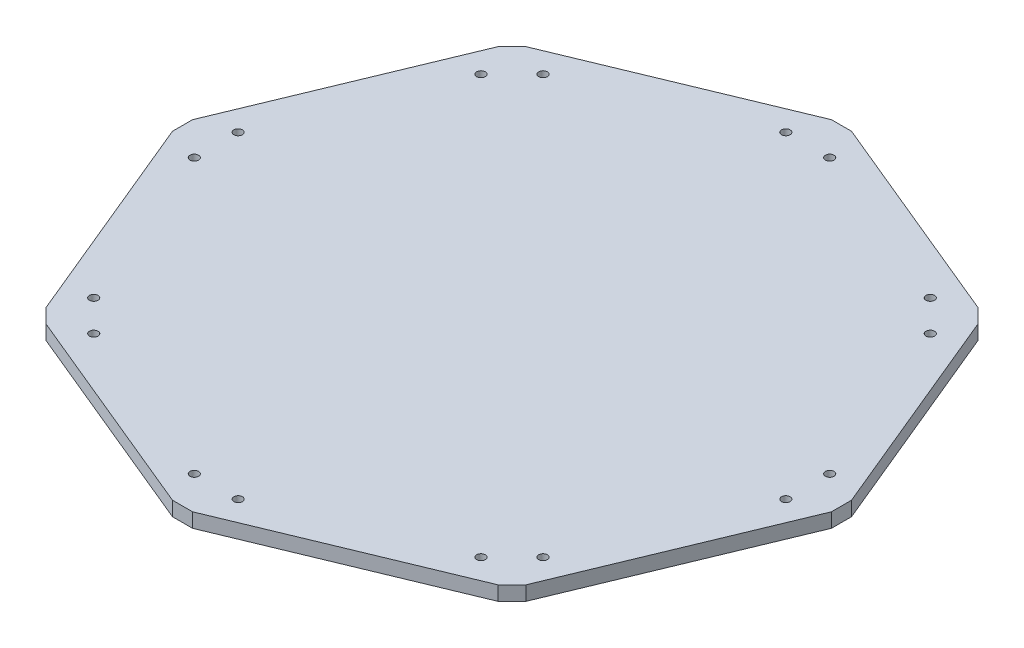
ISO-10303-21;
HEADER;
FILE_DESCRIPTION(('STEP AP214'),'2;1');
FILE_NAME('part.step','',(''),(''),'','','');
FILE_SCHEMA(('AUTOMOTIVE_DESIGN { 1 0 10303 214 1 1 1 1 }'));
ENDSEC;
DATA;
#1=APPLICATION_CONTEXT('core data for automotive mechanical design processes');
#2=APPLICATION_PROTOCOL_DEFINITION('international standard','automotive_design',2000,#1);
#3=PRODUCT_CONTEXT('',#1,'mechanical');
#4=PRODUCT('Part','Part','',(#3));
#5=PRODUCT_RELATED_PRODUCT_CATEGORY('part','',(#4));
#6=PRODUCT_DEFINITION_FORMATION('','',#4);
#7=PRODUCT_DEFINITION_CONTEXT('part definition',#1,'design');
#8=PRODUCT_DEFINITION('design','',#6,#7);
#9=PRODUCT_DEFINITION_SHAPE('','',#8);
#10=(LENGTH_UNIT() NAMED_UNIT(*) SI_UNIT(.MILLI.,.METRE.));
#11=(NAMED_UNIT(*) PLANE_ANGLE_UNIT() SI_UNIT($,.RADIAN.));
#12=(NAMED_UNIT(*) SI_UNIT($,.STERADIAN.) SOLID_ANGLE_UNIT());
#13=UNCERTAINTY_MEASURE_WITH_UNIT(LENGTH_MEASURE(1.E-05),#10,'distance_accuracy_value','');
#14=(GEOMETRIC_REPRESENTATION_CONTEXT(3) GLOBAL_UNCERTAINTY_ASSIGNED_CONTEXT((#13)) GLOBAL_UNIT_ASSIGNED_CONTEXT((#10,
#11,#12)) REPRESENTATION_CONTEXT('',''));
#15=CARTESIAN_POINT('',(0.,0.,0.));
#16=DIRECTION('',(0.,0.,1.));
#17=DIRECTION('',(1.,0.,0.));
#18=AXIS2_PLACEMENT_3D('',#15,#16,#17);
#19=CARTESIAN_POINT('',(12953.3155356963,5.,26694.8257165079));
#20=DIRECTION('',(0.,-1.,0.));
#21=DIRECTION('',(0.,0.,-1.));
#22=AXIS2_PLACEMENT_3D('',#19,#20,#21);
#23=PLANE('',#22);
#24=DIRECTION('',(0.923879532511295,0.,0.382683432365071));
#25=VECTOR('',#24,1.);
#26=CARTESIAN_POINT('',(12946.3155356963,5.,26924.8257165079));
#27=LINE('',#26,#25);
#28=CARTESIAN_POINT('',(12946.3155356963,5.,26924.8257165079));
#29=VERTEX_POINT('',#28);
#30=CARTESIAN_POINT('',(12795.6307234917,5.,26862.4100236491));
#31=VERTEX_POINT('',#30);
#32=EDGE_CURVE('E683',#29,#31,#27,.F.);
#33=ORIENTED_EDGE('',*,*,#32,.F.);
#34=DIRECTION('',(1.,0.,0.));
#35=VECTOR('',#34,1.);
#36=CARTESIAN_POINT('',(12960.3155356963,5.,26924.8257165079));
#37=LINE('',#36,#35);
#38=CARTESIAN_POINT('',(12960.3155356963,5.,26924.8257165079));
#39=VERTEX_POINT('',#38);
#40=EDGE_CURVE('E688',#39,#29,#37,.F.);
#41=ORIENTED_EDGE('',*,*,#40,.F.);
#42=DIRECTION('',(0.923879532511271,0.,-0.382683432365128));
#43=VECTOR('',#42,1.);
#44=CARTESIAN_POINT('',(13111.0003479009,5.,26862.4100236491));
#45=LINE('',#44,#43);
#46=CARTESIAN_POINT('',(13111.0003479009,5.,26862.4100236491));
#47=VERTEX_POINT('',#46);
#48=EDGE_CURVE('E693',#47,#39,#45,.F.);
#49=ORIENTED_EDGE('',*,*,#48,.F.);
#50=DIRECTION('',(0.707106781186548,0.,-0.707106781186548));
#51=VECTOR('',#50,1.);
#52=CARTESIAN_POINT('',(13120.8998428375,5.,26852.5105287125));
#53=LINE('',#52,#51);
#54=CARTESIAN_POINT('',(13120.8998428375,5.,26852.5105287125));
#55=VERTEX_POINT('',#54);
#56=EDGE_CURVE('E699',#55,#47,#53,.F.);
#57=ORIENTED_EDGE('',*,*,#56,.F.);
#58=DIRECTION('',(0.382683432365001,0.,-0.923879532511323));
#59=VECTOR('',#58,1.);
#60=CARTESIAN_POINT('',(13183.3155356963,5.,26701.8257165079));
#61=LINE('',#60,#59);
#62=CARTESIAN_POINT('',(13183.3155356963,5.,26701.8257165079));
#63=VERTEX_POINT('',#62);
#64=EDGE_CURVE('E705',#63,#55,#61,.F.);
#65=ORIENTED_EDGE('',*,*,#64,.F.);
#66=DIRECTION('',(-4.87229304521338E-13,0.,-1.));
#67=VECTOR('',#66,1.);
#68=CARTESIAN_POINT('',(13183.3155356963,5.,26687.8257165079));
#69=LINE('',#68,#67);
#70=CARTESIAN_POINT('',(13183.3155356963,5.,26687.8257165079));
#71=VERTEX_POINT('',#70);
#72=EDGE_CURVE('E711',#71,#63,#69,.F.);
#73=ORIENTED_EDGE('',*,*,#72,.F.);
#74=DIRECTION('',(-0.382683432365128,0.,-0.923879532511271));
#75=VECTOR('',#74,1.);
#76=CARTESIAN_POINT('',(13120.8998428375,5.,26537.1409043033));
#77=LINE('',#76,#75);
#78=CARTESIAN_POINT('',(13120.8998428375,5.,26537.1409043033));
#79=VERTEX_POINT('',#78);
#80=EDGE_CURVE('E717',#79,#71,#77,.F.);
#81=ORIENTED_EDGE('',*,*,#80,.F.);
#82=DIRECTION('',(-0.707106781187035,0.,-0.70710678118606));
#83=VECTOR('',#82,1.);
#84=CARTESIAN_POINT('',(13111.0003479009,5.,26527.2414093667));
#85=LINE('',#84,#83);
#86=CARTESIAN_POINT('',(13111.0003479009,5.,26527.2414093667));
#87=VERTEX_POINT('',#86);
#88=EDGE_CURVE('E723',#87,#79,#85,.F.);
#89=ORIENTED_EDGE('',*,*,#88,.F.);
#90=DIRECTION('',(-0.923879532511295,0.,-0.382683432365071));
#91=VECTOR('',#90,1.);
#92=CARTESIAN_POINT('',(12960.3155356963,5.,26464.8257165079));
#93=LINE('',#92,#91);
#94=CARTESIAN_POINT('',(12960.3155356963,5.,26464.8257165079));
#95=VERTEX_POINT('',#94);
#96=EDGE_CURVE('E729',#95,#87,#93,.F.);
#97=ORIENTED_EDGE('',*,*,#96,.F.);
#98=DIRECTION('',(-1.,0.,6.49639072695118E-13));
#99=VECTOR('',#98,1.);
#100=CARTESIAN_POINT('',(12946.3155356963,5.,26464.8257165079));
#101=LINE('',#100,#99);
#102=CARTESIAN_POINT('',(12946.3155356963,5.,26464.8257165079));
#103=VERTEX_POINT('',#102);
#104=EDGE_CURVE('E735',#103,#95,#101,.F.);
#105=ORIENTED_EDGE('',*,*,#104,.F.);
#106=DIRECTION('',(-0.923879532511271,0.,0.382683432365128));
#107=VECTOR('',#106,1.);
#108=CARTESIAN_POINT('',(12795.6307234917,5.,26527.2414093667));
#109=LINE('',#108,#107);
#110=CARTESIAN_POINT('',(12795.6307234917,5.,26527.2414093667));
#111=VERTEX_POINT('',#110);
#112=EDGE_CURVE('E741',#111,#103,#109,.F.);
#113=ORIENTED_EDGE('',*,*,#112,.F.);
#114=DIRECTION('',(-0.707106781186142,0.,0.707106781186954));
#115=VECTOR('',#114,1.);
#116=CARTESIAN_POINT('',(12785.7312285551,5.,26537.1409043033));
#117=LINE('',#116,#115);
#118=CARTESIAN_POINT('',(12785.7312285551,5.,26537.1409043033));
#119=VERTEX_POINT('',#118);
#120=EDGE_CURVE('E747',#119,#111,#117,.F.);
#121=ORIENTED_EDGE('',*,*,#120,.F.);
#122=DIRECTION('',(-0.382683432365047,0.,0.923879532511305));
#123=VECTOR('',#122,1.);
#124=CARTESIAN_POINT('',(12723.3155356963,5.,26687.8257165079));
#125=LINE('',#124,#123);
#126=CARTESIAN_POINT('',(12723.3155356963,5.,26687.8257165079));
#127=VERTEX_POINT('',#126);
#128=EDGE_CURVE('E751',#127,#119,#125,.F.);
#129=ORIENTED_EDGE('',*,*,#128,.F.);
#130=DIRECTION('',(4.87229304521338E-13,0.,1.));
#131=VECTOR('',#130,1.);
#132=CARTESIAN_POINT('',(12723.3155356963,5.,26701.8257165079));
#133=LINE('',#132,#131);
#134=CARTESIAN_POINT('',(12723.3155356963,5.,26701.8257165079));
#135=VERTEX_POINT('',#134);
#136=EDGE_CURVE('E128',#135,#127,#133,.F.);
#137=ORIENTED_EDGE('',*,*,#136,.F.);
#138=DIRECTION('',(0.382683432365128,0.,0.923879532511271));
#139=VECTOR('',#138,1.);
#140=CARTESIAN_POINT('',(12785.7312285551,5.,26852.5105287125));
#141=LINE('',#140,#139);
#142=CARTESIAN_POINT('',(12785.7312285551,5.,26852.5105287125));
#143=VERTEX_POINT('',#142);
#144=EDGE_CURVE('E130',#143,#135,#141,.F.);
#145=ORIENTED_EDGE('',*,*,#144,.F.);
#146=DIRECTION('',(0.707106781187035,0.,0.70710678118606));
#147=VECTOR('',#146,1.);
#148=CARTESIAN_POINT('',(12795.6307234917,5.,26862.4100236491));
#149=LINE('',#148,#147);
#150=EDGE_CURVE('E133',#31,#143,#149,.F.);
#151=ORIENTED_EDGE('',*,*,#150,.F.);
#152=EDGE_LOOP('',(#33,#41,#49,#57,#65,#73,#81,#89,#97,#105,#113,#121,#129,#137,#145,#151));
#153=FACE_BOUND('',#152,.T.);
#154=CARTESIAN_POINT('',(12968.6304514889,5.,26488.3814010915));
#155=DIRECTION('',(0.,-1.,0.));
#156=DIRECTION('',(0.,0.,-1.));
#157=AXIS2_PLACEMENT_3D('',#154,#155,#156);
#158=CIRCLE('',#157,2.99999999999979);
#159=CARTESIAN_POINT('',(12968.6304514889,5.,26485.3814010915));
#160=VERTEX_POINT('',#159);
#161=EDGE_CURVE('E146',#160,#160,#158,.F.);
#162=ORIENTED_EDGE('',*,*,#161,.F.);
#163=EDGE_LOOP('',(#162));
#164=FACE_BOUND('',#163,.T.);
#165=CARTESIAN_POINT('',(12938.0006199037,5.,26488.3814010916));
#166=DIRECTION('',(0.,-1.,0.));
#167=DIRECTION('',(0.,0.,-1.));
#168=AXIS2_PLACEMENT_3D('',#165,#166,#167);
#169=CIRCLE('',#168,3.00000000000011);
#170=CARTESIAN_POINT('',(12938.0006199037,5.,26485.3814010916));
#171=VERTEX_POINT('',#170);
#172=EDGE_CURVE('E208',#171,#171,#169,.F.);
#173=ORIENTED_EDGE('',*,*,#172,.F.);
#174=EDGE_LOOP('',(#173));
#175=FACE_BOUND('',#174,.T.);
#176=CARTESIAN_POINT('',(13110.1229918748,5.,26559.6768219498));
#177=DIRECTION('',(0.,-1.,0.));
#178=DIRECTION('',(0.,0.,-1.));
#179=AXIS2_PLACEMENT_3D('',#176,#177,#178);
#180=CIRCLE('',#179,3.00000000000011);
#181=CARTESIAN_POINT('',(13110.1229918748,5.,26556.6768219498));
#182=VERTEX_POINT('',#181);
#183=EDGE_CURVE('E211',#182,#182,#180,.F.);
#184=ORIENTED_EDGE('',*,*,#183,.F.);
#185=EDGE_LOOP('',(#184));
#186=FACE_BOUND('',#185,.T.);
#187=CARTESIAN_POINT('',(13088.4644302543,5.,26538.0182603293));
#188=DIRECTION('',(0.,-1.,0.));
#189=DIRECTION('',(0.,0.,-1.));
#190=AXIS2_PLACEMENT_3D('',#187,#188,#189);
#191=CIRCLE('',#190,2.99999999999979);
#192=CARTESIAN_POINT('',(13088.4644302543,5.,26535.0182603293));
#193=VERTEX_POINT('',#192);
#194=EDGE_CURVE('E214',#193,#193,#191,.F.);
#195=ORIENTED_EDGE('',*,*,#194,.F.);
#196=EDGE_LOOP('',(#195));
#197=FACE_BOUND('',#196,.T.);
#198=CARTESIAN_POINT('',(12818.1666411382,5.,26538.0182603293));
#199=DIRECTION('',(0.,-1.,0.));
#200=DIRECTION('',(0.,0.,-1.));
#201=AXIS2_PLACEMENT_3D('',#198,#199,#200);
#202=CIRCLE('',#201,3.00000000000011);
#203=CARTESIAN_POINT('',(12818.1666411382,5.,26535.0182603293));
#204=VERTEX_POINT('',#203);
#205=EDGE_CURVE('E217',#204,#204,#202,.F.);
#206=ORIENTED_EDGE('',*,*,#205,.F.);
#207=EDGE_LOOP('',(#206));
#208=FACE_BOUND('',#207,.T.);
#209=CARTESIAN_POINT('',(12796.5080795177,5.,26559.6768219499));
#210=DIRECTION('',(0.,-1.,0.));
#211=DIRECTION('',(0.,0.,-1.));
#212=AXIS2_PLACEMENT_3D('',#209,#210,#211);
#213=CIRCLE('',#212,2.99999999999979);
#214=CARTESIAN_POINT('',(12796.5080795177,5.,26556.6768219499));
#215=VERTEX_POINT('',#214);
#216=EDGE_CURVE('E220',#215,#215,#213,.F.);
#217=ORIENTED_EDGE('',*,*,#216,.F.);
#218=EDGE_LOOP('',(#217));
#219=FACE_BOUND('',#218,.T.);
#220=CARTESIAN_POINT('',(12746.87122028,5.,26710.1406323005));
#221=DIRECTION('',(0.,-1.,0.));
#222=DIRECTION('',(0.,0.,-1.));
#223=AXIS2_PLACEMENT_3D('',#220,#221,#222);
#224=CIRCLE('',#223,3.00000000000011);
#225=CARTESIAN_POINT('',(12746.87122028,5.,26707.1406323005));
#226=VERTEX_POINT('',#225);
#227=EDGE_CURVE('E223',#226,#226,#224,.F.);
#228=ORIENTED_EDGE('',*,*,#227,.F.);
#229=EDGE_LOOP('',(#228));
#230=FACE_BOUND('',#229,.T.);
#231=CARTESIAN_POINT('',(13159.7598511126,5.,26679.5108007153));
#232=DIRECTION('',(0.,-1.,0.));
#233=DIRECTION('',(0.,0.,-1.));
#234=AXIS2_PLACEMENT_3D('',#231,#232,#233);
#235=CIRCLE('',#234,3.00000000000011);
#236=CARTESIAN_POINT('',(13159.7598511126,5.,26676.5108007153));
#237=VERTEX_POINT('',#236);
#238=EDGE_CURVE('E226',#237,#237,#235,.F.);
#239=ORIENTED_EDGE('',*,*,#238,.F.);
#240=EDGE_LOOP('',(#239));
#241=FACE_BOUND('',#240,.T.);
#242=CARTESIAN_POINT('',(12746.8712202799,5.,26679.5108007153));
#243=DIRECTION('',(0.,-1.,0.));
#244=DIRECTION('',(0.,0.,-1.));
#245=AXIS2_PLACEMENT_3D('',#242,#243,#244);
#246=CIRCLE('',#245,2.99999999999979);
#247=CARTESIAN_POINT('',(12746.8712202799,5.,26676.5108007153));
#248=VERTEX_POINT('',#247);
#249=EDGE_CURVE('E229',#248,#248,#246,.F.);
#250=ORIENTED_EDGE('',*,*,#249,.F.);
#251=EDGE_LOOP('',(#250));
#252=FACE_BOUND('',#251,.T.);
#253=CARTESIAN_POINT('',(13159.7598511126,5.,26710.1406323005));
#254=DIRECTION('',(0.,-1.,0.));
#255=DIRECTION('',(0.,0.,-1.));
#256=AXIS2_PLACEMENT_3D('',#253,#254,#255);
#257=CIRCLE('',#256,2.99999999999979);
#258=CARTESIAN_POINT('',(13159.7598511126,5.,26707.1406323005));
#259=VERTEX_POINT('',#258);
#260=EDGE_CURVE('E232',#259,#259,#257,.F.);
#261=ORIENTED_EDGE('',*,*,#260,.F.);
#262=EDGE_LOOP('',(#261));
#263=FACE_BOUND('',#262,.T.);
#264=CARTESIAN_POINT('',(12796.5080795177,5.,26829.9746110659));
#265=DIRECTION('',(0.,-1.,0.));
#266=DIRECTION('',(0.,0.,-1.));
#267=AXIS2_PLACEMENT_3D('',#264,#265,#266);
#268=CIRCLE('',#267,3.00000000000011);
#269=CARTESIAN_POINT('',(12796.5080795177,5.,26826.9746110659));
#270=VERTEX_POINT('',#269);
#271=EDGE_CURVE('E235',#270,#270,#268,.F.);
#272=ORIENTED_EDGE('',*,*,#271,.F.);
#273=EDGE_LOOP('',(#272));
#274=FACE_BOUND('',#273,.T.);
#275=CARTESIAN_POINT('',(13088.4644302543,5.,26851.6331726865));
#276=DIRECTION('',(0.,-1.,0.));
#277=DIRECTION('',(0.,0.,-1.));
#278=AXIS2_PLACEMENT_3D('',#275,#276,#277);
#279=CIRCLE('',#278,3.00000000000011);
#280=CARTESIAN_POINT('',(13088.4644302543,5.,26848.6331726865));
#281=VERTEX_POINT('',#280);
#282=EDGE_CURVE('E238',#281,#281,#279,.F.);
#283=ORIENTED_EDGE('',*,*,#282,.F.);
#284=EDGE_LOOP('',(#283));
#285=FACE_BOUND('',#284,.T.);
#286=CARTESIAN_POINT('',(13110.1229918748,5.,26829.9746110659));
#287=DIRECTION('',(0.,-1.,0.));
#288=DIRECTION('',(0.,0.,-1.));
#289=AXIS2_PLACEMENT_3D('',#286,#287,#288);
#290=CIRCLE('',#289,2.99999999999979);
#291=CARTESIAN_POINT('',(13110.1229918748,5.,26826.9746110659));
#292=VERTEX_POINT('',#291);
#293=EDGE_CURVE('E241',#292,#292,#290,.F.);
#294=ORIENTED_EDGE('',*,*,#293,.F.);
#295=EDGE_LOOP('',(#294));
#296=FACE_BOUND('',#295,.T.);
#297=CARTESIAN_POINT('',(12818.1666411383,5.,26851.6331726864));
#298=DIRECTION('',(0.,-1.,0.));
#299=DIRECTION('',(0.,0.,-1.));
#300=AXIS2_PLACEMENT_3D('',#297,#298,#299);
#301=CIRCLE('',#300,2.99999999999979);
#302=CARTESIAN_POINT('',(12818.1666411383,5.,26848.6331726864));
#303=VERTEX_POINT('',#302);
#304=EDGE_CURVE('E244',#303,#303,#301,.F.);
#305=ORIENTED_EDGE('',*,*,#304,.F.);
#306=EDGE_LOOP('',(#305));
#307=FACE_BOUND('',#306,.T.);
#308=CARTESIAN_POINT('',(12938.0006199037,5.,26901.2700319242));
#309=DIRECTION('',(0.,-1.,0.));
#310=DIRECTION('',(0.,0.,-1.));
#311=AXIS2_PLACEMENT_3D('',#308,#309,#310);
#312=CIRCLE('',#311,2.99999999999979);
#313=CARTESIAN_POINT('',(12938.0006199037,5.,26898.2700319242));
#314=VERTEX_POINT('',#313);
#315=EDGE_CURVE('E246',#314,#314,#312,.F.);
#316=ORIENTED_EDGE('',*,*,#315,.F.);
#317=EDGE_LOOP('',(#316));
#318=FACE_BOUND('',#317,.T.);
#319=CARTESIAN_POINT('',(12968.6304514889,5.,26901.2700319242));
#320=DIRECTION('',(0.,-1.,0.));
#321=DIRECTION('',(0.,0.,-1.));
#322=AXIS2_PLACEMENT_3D('',#319,#320,#321);
#323=CIRCLE('',#322,3.00000000000011);
#324=CARTESIAN_POINT('',(12968.6304514889,5.,26898.2700319242));
#325=VERTEX_POINT('',#324);
#326=EDGE_CURVE('E20',#325,#325,#323,.F.);
#327=ORIENTED_EDGE('',*,*,#326,.F.);
#328=EDGE_LOOP('',(#327));
#329=FACE_BOUND('',#328,.T.);
#330=ADVANCED_FACE('F17',(#153,#164,#175,#186,#197,#208,#219,#230,#241,#252,#263,#274,#285,#296,
#307,#318,#329),#23,.F.);
#331=CARTESIAN_POINT('',(12968.6304514889,5.,26901.2700319242));
#332=DIRECTION('',(0.,-1.,0.));
#333=DIRECTION('',(0.,0.,-1.));
#334=AXIS2_PLACEMENT_3D('',#331,#332,#333);
#335=CYLINDRICAL_SURFACE('',#334,3.00000000000011);
#336=ORIENTED_EDGE('',*,*,#326,.T.);
#337=EDGE_LOOP('',(#336));
#338=FACE_BOUND('',#337,.T.);
#339=CARTESIAN_POINT('',(12968.6304514889,-5.,26901.2700319242));
#340=DIRECTION('',(0.,-1.,0.));
#341=DIRECTION('',(0.,0.,-1.));
#342=AXIS2_PLACEMENT_3D('',#339,#340,#341);
#343=CIRCLE('',#342,3.00000000000011);
#344=CARTESIAN_POINT('',(12968.6304514889,-5.,26898.2700319242));
#345=VERTEX_POINT('',#344);
#346=EDGE_CURVE('E203',#345,#345,#343,.F.);
#347=ORIENTED_EDGE('',*,*,#346,.F.);
#348=EDGE_LOOP('',(#347));
#349=FACE_BOUND('',#348,.T.);
#350=ADVANCED_FACE('F253',(#338,#349),#335,.F.);
#351=CARTESIAN_POINT('',(12938.0006199037,5.,26901.2700319242));
#352=DIRECTION('',(0.,-1.,0.));
#353=DIRECTION('',(0.,0.,-1.));
#354=AXIS2_PLACEMENT_3D('',#351,#352,#353);
#355=CYLINDRICAL_SURFACE('',#354,2.99999999999979);
#356=ORIENTED_EDGE('',*,*,#315,.T.);
#357=EDGE_LOOP('',(#356));
#358=FACE_BOUND('',#357,.T.);
#359=CARTESIAN_POINT('',(12938.0006199037,-5.,26901.2700319242));
#360=DIRECTION('',(0.,-1.,0.));
#361=DIRECTION('',(0.,0.,-1.));
#362=AXIS2_PLACEMENT_3D('',#359,#360,#361);
#363=CIRCLE('',#362,2.99999999999979);
#364=CARTESIAN_POINT('',(12938.0006199037,-5.,26898.2700319242));
#365=VERTEX_POINT('',#364);
#366=EDGE_CURVE('E200',#365,#365,#363,.F.);
#367=ORIENTED_EDGE('',*,*,#366,.F.);
#368=EDGE_LOOP('',(#367));
#369=FACE_BOUND('',#368,.T.);
#370=ADVANCED_FACE('F261',(#358,#369),#355,.F.);
#371=CARTESIAN_POINT('',(12818.1666411383,5.,26851.6331726864));
#372=DIRECTION('',(0.,-1.,0.));
#373=DIRECTION('',(0.,0.,-1.));
#374=AXIS2_PLACEMENT_3D('',#371,#372,#373);
#375=CYLINDRICAL_SURFACE('',#374,2.99999999999979);
#376=ORIENTED_EDGE('',*,*,#304,.T.);
#377=EDGE_LOOP('',(#376));
#378=FACE_BOUND('',#377,.T.);
#379=CARTESIAN_POINT('',(12818.1666411383,-5.,26851.6331726864));
#380=DIRECTION('',(0.,-1.,0.));
#381=DIRECTION('',(0.,0.,-1.));
#382=AXIS2_PLACEMENT_3D('',#379,#380,#381);
#383=CIRCLE('',#382,2.99999999999979);
#384=CARTESIAN_POINT('',(12818.1666411383,-5.,26848.6331726864));
#385=VERTEX_POINT('',#384);
#386=EDGE_CURVE('E197',#385,#385,#383,.F.);
#387=ORIENTED_EDGE('',*,*,#386,.F.);
#388=EDGE_LOOP('',(#387));
#389=FACE_BOUND('',#388,.T.);
#390=ADVANCED_FACE('F381',(#378,#389),#375,.F.);
#391=CARTESIAN_POINT('',(13110.1229918748,5.,26829.9746110659));
#392=DIRECTION('',(0.,-1.,0.));
#393=DIRECTION('',(0.,0.,-1.));
#394=AXIS2_PLACEMENT_3D('',#391,#392,#393);
#395=CYLINDRICAL_SURFACE('',#394,2.99999999999979);
#396=ORIENTED_EDGE('',*,*,#293,.T.);
#397=EDGE_LOOP('',(#396));
#398=FACE_BOUND('',#397,.T.);
#399=CARTESIAN_POINT('',(13110.1229918748,-5.,26829.9746110659));
#400=DIRECTION('',(0.,-1.,0.));
#401=DIRECTION('',(0.,0.,-1.));
#402=AXIS2_PLACEMENT_3D('',#399,#400,#401);
#403=CIRCLE('',#402,2.99999999999979);
#404=CARTESIAN_POINT('',(13110.1229918748,-5.,26826.9746110659));
#405=VERTEX_POINT('',#404);
#406=EDGE_CURVE('E194',#405,#405,#403,.F.);
#407=ORIENTED_EDGE('',*,*,#406,.F.);
#408=EDGE_LOOP('',(#407));
#409=FACE_BOUND('',#408,.T.);
#410=ADVANCED_FACE('F377',(#398,#409),#395,.F.);
#411=CARTESIAN_POINT('',(13088.4644302543,5.,26851.6331726865));
#412=DIRECTION('',(0.,-1.,0.));
#413=DIRECTION('',(0.,0.,-1.));
#414=AXIS2_PLACEMENT_3D('',#411,#412,#413);
#415=CYLINDRICAL_SURFACE('',#414,3.00000000000011);
#416=ORIENTED_EDGE('',*,*,#282,.T.);
#417=EDGE_LOOP('',(#416));
#418=FACE_BOUND('',#417,.T.);
#419=CARTESIAN_POINT('',(13088.4644302543,-5.,26851.6331726865));
#420=DIRECTION('',(0.,-1.,0.));
#421=DIRECTION('',(0.,0.,-1.));
#422=AXIS2_PLACEMENT_3D('',#419,#420,#421);
#423=CIRCLE('',#422,3.00000000000011);
#424=CARTESIAN_POINT('',(13088.4644302543,-5.,26848.6331726865));
#425=VERTEX_POINT('',#424);
#426=EDGE_CURVE('E191',#425,#425,#423,.F.);
#427=ORIENTED_EDGE('',*,*,#426,.F.);
#428=EDGE_LOOP('',(#427));
#429=FACE_BOUND('',#428,.T.);
#430=ADVANCED_FACE('F373',(#418,#429),#415,.F.);
#431=CARTESIAN_POINT('',(12796.5080795177,5.,26829.9746110659));
#432=DIRECTION('',(0.,-1.,0.));
#433=DIRECTION('',(0.,0.,-1.));
#434=AXIS2_PLACEMENT_3D('',#431,#432,#433);
#435=CYLINDRICAL_SURFACE('',#434,3.00000000000011);
#436=ORIENTED_EDGE('',*,*,#271,.T.);
#437=EDGE_LOOP('',(#436));
#438=FACE_BOUND('',#437,.T.);
#439=CARTESIAN_POINT('',(12796.5080795177,-5.,26829.9746110659));
#440=DIRECTION('',(0.,-1.,0.));
#441=DIRECTION('',(0.,0.,-1.));
#442=AXIS2_PLACEMENT_3D('',#439,#440,#441);
#443=CIRCLE('',#442,3.00000000000011);
#444=CARTESIAN_POINT('',(12796.5080795177,-5.,26826.9746110659));
#445=VERTEX_POINT('',#444);
#446=EDGE_CURVE('E188',#445,#445,#443,.F.);
#447=ORIENTED_EDGE('',*,*,#446,.F.);
#448=EDGE_LOOP('',(#447));
#449=FACE_BOUND('',#448,.T.);
#450=ADVANCED_FACE('F369',(#438,#449),#435,.F.);
#451=CARTESIAN_POINT('',(13159.7598511126,5.,26710.1406323005));
#452=DIRECTION('',(0.,-1.,0.));
#453=DIRECTION('',(0.,0.,-1.));
#454=AXIS2_PLACEMENT_3D('',#451,#452,#453);
#455=CYLINDRICAL_SURFACE('',#454,2.99999999999979);
#456=ORIENTED_EDGE('',*,*,#260,.T.);
#457=EDGE_LOOP('',(#456));
#458=FACE_BOUND('',#457,.T.);
#459=CARTESIAN_POINT('',(13159.7598511126,-5.,26710.1406323005));
#460=DIRECTION('',(0.,-1.,0.));
#461=DIRECTION('',(0.,0.,-1.));
#462=AXIS2_PLACEMENT_3D('',#459,#460,#461);
#463=CIRCLE('',#462,2.99999999999979);
#464=CARTESIAN_POINT('',(13159.7598511126,-5.,26707.1406323005));
#465=VERTEX_POINT('',#464);
#466=EDGE_CURVE('E185',#465,#465,#463,.F.);
#467=ORIENTED_EDGE('',*,*,#466,.F.);
#468=EDGE_LOOP('',(#467));
#469=FACE_BOUND('',#468,.T.);
#470=ADVANCED_FACE('F365',(#458,#469),#455,.F.);
#471=CARTESIAN_POINT('',(12746.8712202799,5.,26679.5108007153));
#472=DIRECTION('',(0.,-1.,0.));
#473=DIRECTION('',(0.,0.,-1.));
#474=AXIS2_PLACEMENT_3D('',#471,#472,#473);
#475=CYLINDRICAL_SURFACE('',#474,2.99999999999979);
#476=ORIENTED_EDGE('',*,*,#249,.T.);
#477=EDGE_LOOP('',(#476));
#478=FACE_BOUND('',#477,.T.);
#479=CARTESIAN_POINT('',(12746.8712202799,-5.,26679.5108007153));
#480=DIRECTION('',(0.,-1.,0.));
#481=DIRECTION('',(0.,0.,-1.));
#482=AXIS2_PLACEMENT_3D('',#479,#480,#481);
#483=CIRCLE('',#482,2.99999999999979);
#484=CARTESIAN_POINT('',(12746.8712202799,-5.,26676.5108007153));
#485=VERTEX_POINT('',#484);
#486=EDGE_CURVE('E182',#485,#485,#483,.F.);
#487=ORIENTED_EDGE('',*,*,#486,.F.);
#488=EDGE_LOOP('',(#487));
#489=FACE_BOUND('',#488,.T.);
#490=ADVANCED_FACE('F361',(#478,#489),#475,.F.);
#491=CARTESIAN_POINT('',(13159.7598511126,5.,26679.5108007153));
#492=DIRECTION('',(0.,-1.,0.));
#493=DIRECTION('',(0.,0.,-1.));
#494=AXIS2_PLACEMENT_3D('',#491,#492,#493);
#495=CYLINDRICAL_SURFACE('',#494,3.00000000000011);
#496=ORIENTED_EDGE('',*,*,#238,.T.);
#497=EDGE_LOOP('',(#496));
#498=FACE_BOUND('',#497,.T.);
#499=CARTESIAN_POINT('',(13159.7598511126,-5.,26679.5108007153));
#500=DIRECTION('',(0.,-1.,0.));
#501=DIRECTION('',(0.,0.,-1.));
#502=AXIS2_PLACEMENT_3D('',#499,#500,#501);
#503=CIRCLE('',#502,3.00000000000011);
#504=CARTESIAN_POINT('',(13159.7598511126,-5.,26676.5108007153));
#505=VERTEX_POINT('',#504);
#506=EDGE_CURVE('E179',#505,#505,#503,.F.);
#507=ORIENTED_EDGE('',*,*,#506,.F.);
#508=EDGE_LOOP('',(#507));
#509=FACE_BOUND('',#508,.T.);
#510=ADVANCED_FACE('F357',(#498,#509),#495,.F.);
#511=CARTESIAN_POINT('',(12746.87122028,5.,26710.1406323005));
#512=DIRECTION('',(0.,-1.,0.));
#513=DIRECTION('',(0.,0.,-1.));
#514=AXIS2_PLACEMENT_3D('',#511,#512,#513);
#515=CYLINDRICAL_SURFACE('',#514,3.00000000000011);
#516=ORIENTED_EDGE('',*,*,#227,.T.);
#517=EDGE_LOOP('',(#516));
#518=FACE_BOUND('',#517,.T.);
#519=CARTESIAN_POINT('',(12746.87122028,-5.,26710.1406323005));
#520=DIRECTION('',(0.,-1.,0.));
#521=DIRECTION('',(0.,0.,-1.));
#522=AXIS2_PLACEMENT_3D('',#519,#520,#521);
#523=CIRCLE('',#522,3.00000000000011);
#524=CARTESIAN_POINT('',(12746.87122028,-5.,26707.1406323005));
#525=VERTEX_POINT('',#524);
#526=EDGE_CURVE('E176',#525,#525,#523,.F.);
#527=ORIENTED_EDGE('',*,*,#526,.F.);
#528=EDGE_LOOP('',(#527));
#529=FACE_BOUND('',#528,.T.);
#530=ADVANCED_FACE('F353',(#518,#529),#515,.F.);
#531=CARTESIAN_POINT('',(12796.5080795177,5.,26559.6768219499));
#532=DIRECTION('',(0.,-1.,0.));
#533=DIRECTION('',(0.,0.,-1.));
#534=AXIS2_PLACEMENT_3D('',#531,#532,#533);
#535=CYLINDRICAL_SURFACE('',#534,2.99999999999979);
#536=ORIENTED_EDGE('',*,*,#216,.T.);
#537=EDGE_LOOP('',(#536));
#538=FACE_BOUND('',#537,.T.);
#539=CARTESIAN_POINT('',(12796.5080795177,-5.,26559.6768219499));
#540=DIRECTION('',(0.,-1.,0.));
#541=DIRECTION('',(0.,0.,-1.));
#542=AXIS2_PLACEMENT_3D('',#539,#540,#541);
#543=CIRCLE('',#542,2.99999999999979);
#544=CARTESIAN_POINT('',(12796.5080795177,-5.,26556.6768219499));
#545=VERTEX_POINT('',#544);
#546=EDGE_CURVE('E173',#545,#545,#543,.F.);
#547=ORIENTED_EDGE('',*,*,#546,.F.);
#548=EDGE_LOOP('',(#547));
#549=FACE_BOUND('',#548,.T.);
#550=ADVANCED_FACE('F349',(#538,#549),#535,.F.);
#551=CARTESIAN_POINT('',(12818.1666411382,5.,26538.0182603293));
#552=DIRECTION('',(0.,-1.,0.));
#553=DIRECTION('',(0.,0.,-1.));
#554=AXIS2_PLACEMENT_3D('',#551,#552,#553);
#555=CYLINDRICAL_SURFACE('',#554,3.00000000000011);
#556=ORIENTED_EDGE('',*,*,#205,.T.);
#557=EDGE_LOOP('',(#556));
#558=FACE_BOUND('',#557,.T.);
#559=CARTESIAN_POINT('',(12818.1666411382,-5.,26538.0182603293));
#560=DIRECTION('',(0.,-1.,0.));
#561=DIRECTION('',(0.,0.,-1.));
#562=AXIS2_PLACEMENT_3D('',#559,#560,#561);
#563=CIRCLE('',#562,3.00000000000011);
#564=CARTESIAN_POINT('',(12818.1666411382,-5.,26535.0182603293));
#565=VERTEX_POINT('',#564);
#566=EDGE_CURVE('E170',#565,#565,#563,.F.);
#567=ORIENTED_EDGE('',*,*,#566,.F.);
#568=EDGE_LOOP('',(#567));
#569=FACE_BOUND('',#568,.T.);
#570=ADVANCED_FACE('F345',(#558,#569),#555,.F.);
#571=CARTESIAN_POINT('',(13088.4644302543,5.,26538.0182603293));
#572=DIRECTION('',(0.,-1.,0.));
#573=DIRECTION('',(0.,0.,-1.));
#574=AXIS2_PLACEMENT_3D('',#571,#572,#573);
#575=CYLINDRICAL_SURFACE('',#574,2.99999999999979);
#576=ORIENTED_EDGE('',*,*,#194,.T.);
#577=EDGE_LOOP('',(#576));
#578=FACE_BOUND('',#577,.T.);
#579=CARTESIAN_POINT('',(13088.4644302543,-5.,26538.0182603293));
#580=DIRECTION('',(0.,-1.,0.));
#581=DIRECTION('',(0.,0.,-1.));
#582=AXIS2_PLACEMENT_3D('',#579,#580,#581);
#583=CIRCLE('',#582,2.99999999999979);
#584=CARTESIAN_POINT('',(13088.4644302543,-5.,26535.0182603293));
#585=VERTEX_POINT('',#584);
#586=EDGE_CURVE('E167',#585,#585,#583,.F.);
#587=ORIENTED_EDGE('',*,*,#586,.F.);
#588=EDGE_LOOP('',(#587));
#589=FACE_BOUND('',#588,.T.);
#590=ADVANCED_FACE('F341',(#578,#589),#575,.F.);
#591=CARTESIAN_POINT('',(13110.1229918748,5.,26559.6768219498));
#592=DIRECTION('',(0.,-1.,0.));
#593=DIRECTION('',(0.,0.,-1.));
#594=AXIS2_PLACEMENT_3D('',#591,#592,#593);
#595=CYLINDRICAL_SURFACE('',#594,3.00000000000011);
#596=ORIENTED_EDGE('',*,*,#183,.T.);
#597=EDGE_LOOP('',(#596));
#598=FACE_BOUND('',#597,.T.);
#599=CARTESIAN_POINT('',(13110.1229918748,-5.,26559.6768219498));
#600=DIRECTION('',(0.,-1.,0.));
#601=DIRECTION('',(0.,0.,-1.));
#602=AXIS2_PLACEMENT_3D('',#599,#600,#601);
#603=CIRCLE('',#602,3.00000000000011);
#604=CARTESIAN_POINT('',(13110.1229918748,-5.,26556.6768219498));
#605=VERTEX_POINT('',#604);
#606=EDGE_CURVE('E164',#605,#605,#603,.F.);
#607=ORIENTED_EDGE('',*,*,#606,.F.);
#608=EDGE_LOOP('',(#607));
#609=FACE_BOUND('',#608,.T.);
#610=ADVANCED_FACE('F337',(#598,#609),#595,.F.);
#611=CARTESIAN_POINT('',(12938.0006199037,5.,26488.3814010916));
#612=DIRECTION('',(0.,-1.,0.));
#613=DIRECTION('',(0.,0.,-1.));
#614=AXIS2_PLACEMENT_3D('',#611,#612,#613);
#615=CYLINDRICAL_SURFACE('',#614,3.00000000000011);
#616=ORIENTED_EDGE('',*,*,#172,.T.);
#617=EDGE_LOOP('',(#616));
#618=FACE_BOUND('',#617,.T.);
#619=CARTESIAN_POINT('',(12938.0006199037,-5.,26488.3814010916));
#620=DIRECTION('',(0.,-1.,0.));
#621=DIRECTION('',(0.,0.,-1.));
#622=AXIS2_PLACEMENT_3D('',#619,#620,#621);
#623=CIRCLE('',#622,3.00000000000011);
#624=CARTESIAN_POINT('',(12938.0006199037,-5.,26485.3814010916));
#625=VERTEX_POINT('',#624);
#626=EDGE_CURVE('E161',#625,#625,#623,.F.);
#627=ORIENTED_EDGE('',*,*,#626,.F.);
#628=EDGE_LOOP('',(#627));
#629=FACE_BOUND('',#628,.T.);
#630=ADVANCED_FACE('F333',(#618,#629),#615,.F.);
#631=CARTESIAN_POINT('',(12968.6304514889,5.,26488.3814010915));
#632=DIRECTION('',(0.,-1.,0.));
#633=DIRECTION('',(0.,0.,-1.));
#634=AXIS2_PLACEMENT_3D('',#631,#632,#633);
#635=CYLINDRICAL_SURFACE('',#634,2.99999999999979);
#636=ORIENTED_EDGE('',*,*,#161,.T.);
#637=EDGE_LOOP('',(#636));
#638=FACE_BOUND('',#637,.T.);
#639=CARTESIAN_POINT('',(12968.6304514889,-5.,26488.3814010915));
#640=DIRECTION('',(0.,-1.,0.));
#641=DIRECTION('',(0.,0.,-1.));
#642=AXIS2_PLACEMENT_3D('',#639,#640,#641);
#643=CIRCLE('',#642,2.99999999999979);
#644=CARTESIAN_POINT('',(12968.6304514889,-5.,26485.3814010915));
#645=VERTEX_POINT('',#644);
#646=EDGE_CURVE('E157',#645,#645,#643,.F.);
#647=ORIENTED_EDGE('',*,*,#646,.F.);
#648=EDGE_LOOP('',(#647));
#649=FACE_BOUND('',#648,.T.);
#650=ADVANCED_FACE('F330',(#638,#649),#635,.F.);
#651=CARTESIAN_POINT('',(12795.6307234917,5.,26862.4100236491));
#652=DIRECTION('',(-0.70710678118606,0.,0.707106781187035));
#653=DIRECTION('',(0.707106781187035,0.,0.70710678118606));
#654=AXIS2_PLACEMENT_3D('',#651,#652,#653);
#655=PLANE('',#654);
#656=DIRECTION('',(-0.707106781186928,0.,-0.707106781186167));
#657=VECTOR('',#656,1.);
#658=CARTESIAN_POINT('',(12795.6307234917,-5.,26862.4100236491));
#659=LINE('',#658,#657);
#660=CARTESIAN_POINT('',(12795.6307234917,-5.,26862.4100236491));
#661=VERTEX_POINT('',#660);
#662=CARTESIAN_POINT('',(12785.7312285551,-5.,26852.5105287125));
#663=VERTEX_POINT('',#662);
#664=EDGE_CURVE('E160',#661,#663,#659,.T.);
#665=ORIENTED_EDGE('',*,*,#664,.F.);
#666=DIRECTION('',(0.,1.,0.));
#667=VECTOR('',#666,1.);
#668=CARTESIAN_POINT('',(12795.6307234917,5.,26862.4100236491));
#669=LINE('',#668,#667);
#670=EDGE_CURVE('E144',#31,#661,#669,.F.);
#671=ORIENTED_EDGE('',*,*,#670,.F.);
#672=ORIENTED_EDGE('',*,*,#150,.T.);
#673=DIRECTION('',(0.,1.,0.));
#674=VECTOR('',#673,1.);
#675=CARTESIAN_POINT('',(12785.7312285551,5.,26852.5105287125));
#676=LINE('',#675,#674);
#677=EDGE_CURVE('E138',#663,#143,#676,.T.);
#678=ORIENTED_EDGE('',*,*,#677,.F.);
#679=EDGE_LOOP('',(#665,#671,#672,#678));
#680=FACE_BOUND('',#679,.T.);
#681=ADVANCED_FACE('F141',(#680),#655,.T.);
#682=CARTESIAN_POINT('',(12785.7312285551,5.,26852.5105287125));
#683=DIRECTION('',(-0.923879532511271,0.,0.382683432365128));
#684=DIRECTION('',(0.382683432365128,0.,0.923879532511271));
#685=AXIS2_PLACEMENT_3D('',#682,#683,#684);
#686=PLANE('',#685);
#687=DIRECTION('',(-0.382683432365135,0.,-0.923879532511268));
#688=VECTOR('',#687,1.);
#689=CARTESIAN_POINT('',(12785.7312285551,-5.,26852.5105287125));
#690=LINE('',#689,#688);
#691=CARTESIAN_POINT('',(12723.3155356963,-5.,26701.8257165079));
#692=VERTEX_POINT('',#691);
#693=EDGE_CURVE('E150',#663,#692,#690,.T.);
#694=ORIENTED_EDGE('',*,*,#693,.F.);
#695=ORIENTED_EDGE('',*,*,#677,.T.);
#696=ORIENTED_EDGE('',*,*,#144,.T.);
#697=DIRECTION('',(0.,1.,0.));
#698=VECTOR('',#697,1.);
#699=CARTESIAN_POINT('',(12723.3155356963,5.,26701.8257165079));
#700=LINE('',#699,#698);
#701=EDGE_CURVE('E153',#692,#135,#700,.T.);
#702=ORIENTED_EDGE('',*,*,#701,.F.);
#703=EDGE_LOOP('',(#694,#695,#696,#702));
#704=FACE_BOUND('',#703,.T.);
#705=ADVANCED_FACE('F148',(#704),#686,.T.);
#706=CARTESIAN_POINT('',(12723.3155356963,5.,26701.8257165079));
#707=DIRECTION('',(-1.,0.,4.87229304521338E-13));
#708=DIRECTION('',(4.87229304521338E-13,0.,1.));
#709=AXIS2_PLACEMENT_3D('',#706,#707,#708);
#710=PLANE('',#709);
#711=DIRECTION('',(0.,0.,-1.));
#712=VECTOR('',#711,1.);
#713=CARTESIAN_POINT('',(12723.3155356963,-5.,26694.8257165079));
#714=LINE('',#713,#712);
#715=CARTESIAN_POINT('',(12723.3155356963,-5.,26687.8257165079));
#716=VERTEX_POINT('',#715);
#717=EDGE_CURVE('E670',#692,#716,#714,.T.);
#718=ORIENTED_EDGE('',*,*,#717,.F.);
#719=ORIENTED_EDGE('',*,*,#701,.T.);
#720=ORIENTED_EDGE('',*,*,#136,.T.);
#721=DIRECTION('',(0.,1.,0.));
#722=VECTOR('',#721,1.);
#723=CARTESIAN_POINT('',(12723.3155356963,5.,26687.8257165079));
#724=LINE('',#723,#722);
#725=EDGE_CURVE('E672',#716,#127,#724,.T.);
#726=ORIENTED_EDGE('',*,*,#725,.F.);
#727=EDGE_LOOP('',(#718,#719,#720,#726));
#728=FACE_BOUND('',#727,.T.);
#729=ADVANCED_FACE('F321',(#728),#710,.T.);
#730=CARTESIAN_POINT('',(12723.3155356963,5.,26687.8257165079));
#731=DIRECTION('',(-0.923879532511305,0.,-0.382683432365047));
#732=DIRECTION('',(-0.382683432365047,0.,0.923879532511305));
#733=AXIS2_PLACEMENT_3D('',#730,#731,#732);
#734=PLANE('',#733);
#735=DIRECTION('',(0.382683432365046,0.,-0.923879532511305));
#736=VECTOR('',#735,1.);
#737=CARTESIAN_POINT('',(12723.3155356963,-5.,26687.8257165079));
#738=LINE('',#737,#736);
#739=CARTESIAN_POINT('',(12785.7312285551,-5.,26537.1409043033));
#740=VERTEX_POINT('',#739);
#741=EDGE_CURVE('E675',#716,#740,#738,.T.);
#742=ORIENTED_EDGE('',*,*,#741,.F.);
#743=ORIENTED_EDGE('',*,*,#725,.T.);
#744=ORIENTED_EDGE('',*,*,#128,.T.);
#745=DIRECTION('',(0.,1.,0.));
#746=VECTOR('',#745,1.);
#747=CARTESIAN_POINT('',(12785.7312285551,5.,26537.1409043033));
#748=LINE('',#747,#746);
#749=EDGE_CURVE('E744',#740,#119,#748,.T.);
#750=ORIENTED_EDGE('',*,*,#749,.F.);
#751=EDGE_LOOP('',(#742,#743,#744,#750));
#752=FACE_BOUND('',#751,.T.);
#753=ADVANCED_FACE('F317',(#752),#734,.T.);
#754=CARTESIAN_POINT('',(12785.7312285551,5.,26537.1409043033));
#755=DIRECTION('',(-0.707106781186954,0.,-0.707106781186142));
#756=DIRECTION('',(-0.707106781186142,0.,0.707106781186954));
#757=AXIS2_PLACEMENT_3D('',#754,#755,#756);
#758=PLANE('',#757);
#759=DIRECTION('',(0.707106781186167,0.,-0.707106781186928));
#760=VECTOR('',#759,1.);
#761=CARTESIAN_POINT('',(12785.7312285551,-5.,26537.1409043033));
#762=LINE('',#761,#760);
#763=CARTESIAN_POINT('',(12795.6307234917,-5.,26527.2414093667));
#764=VERTEX_POINT('',#763);
#765=EDGE_CURVE('E755',#740,#764,#762,.T.);
#766=ORIENTED_EDGE('',*,*,#765,.F.);
#767=ORIENTED_EDGE('',*,*,#749,.T.);
#768=ORIENTED_EDGE('',*,*,#120,.T.);
#769=DIRECTION('',(0.,1.,0.));
#770=VECTOR('',#769,1.);
#771=CARTESIAN_POINT('',(12795.6307234917,5.,26527.2414093667));
#772=LINE('',#771,#770);
#773=EDGE_CURVE('E738',#764,#111,#772,.T.);
#774=ORIENTED_EDGE('',*,*,#773,.F.);
#775=EDGE_LOOP('',(#766,#767,#768,#774));
#776=FACE_BOUND('',#775,.T.);
#777=ADVANCED_FACE('F313',(#776),#758,.T.);
#778=CARTESIAN_POINT('',(12795.6307234917,5.,26527.2414093667));
#779=DIRECTION('',(-0.382683432365128,0.,-0.923879532511271));
#780=DIRECTION('',(-0.923879532511271,0.,0.382683432365128));
#781=AXIS2_PLACEMENT_3D('',#778,#779,#780);
#782=PLANE('',#781);
#783=DIRECTION('',(0.923879532511271,0.,-0.382683432365128));
#784=VECTOR('',#783,1.);
#785=CARTESIAN_POINT('',(12795.6307234917,-5.,26527.2414093667));
#786=LINE('',#785,#784);
#787=CARTESIAN_POINT('',(12946.3155356963,-5.,26464.8257165079));
#788=VERTEX_POINT('',#787);
#789=EDGE_CURVE('E758',#764,#788,#786,.T.);
#790=ORIENTED_EDGE('',*,*,#789,.F.);
#791=ORIENTED_EDGE('',*,*,#773,.T.);
#792=ORIENTED_EDGE('',*,*,#112,.T.);
#793=DIRECTION('',(0.,1.,0.));
#794=VECTOR('',#793,1.);
#795=CARTESIAN_POINT('',(12946.3155356963,5.,26464.8257165079));
#796=LINE('',#795,#794);
#797=EDGE_CURVE('E732',#788,#103,#796,.T.);
#798=ORIENTED_EDGE('',*,*,#797,.F.);
#799=EDGE_LOOP('',(#790,#791,#792,#798));
#800=FACE_BOUND('',#799,.T.);
#801=ADVANCED_FACE('F309',(#800),#782,.T.);
#802=CARTESIAN_POINT('',(12946.3155356963,5.,26464.8257165079));
#803=DIRECTION('',(-6.49639072695118E-13,0.,-1.));
#804=DIRECTION('',(-1.,0.,6.49639072695118E-13));
#805=AXIS2_PLACEMENT_3D('',#802,#803,#804);
#806=PLANE('',#805);
#807=DIRECTION('',(1.,0.,0.));
#808=VECTOR('',#807,1.);
#809=CARTESIAN_POINT('',(12953.3155356963,-5.,26464.8257165079));
#810=LINE('',#809,#808);
#811=CARTESIAN_POINT('',(12960.3155356963,-5.,26464.8257165079));
#812=VERTEX_POINT('',#811);
#813=EDGE_CURVE('E762',#788,#812,#810,.T.);
#814=ORIENTED_EDGE('',*,*,#813,.F.);
#815=ORIENTED_EDGE('',*,*,#797,.T.);
#816=ORIENTED_EDGE('',*,*,#104,.T.);
#817=DIRECTION('',(0.,1.,0.));
#818=VECTOR('',#817,1.);
#819=CARTESIAN_POINT('',(12960.3155356963,5.,26464.8257165079));
#820=LINE('',#819,#818);
#821=EDGE_CURVE('E726',#812,#95,#820,.T.);
#822=ORIENTED_EDGE('',*,*,#821,.F.);
#823=EDGE_LOOP('',(#814,#815,#816,#822));
#824=FACE_BOUND('',#823,.T.);
#825=ADVANCED_FACE('F305',(#824),#806,.T.);
#826=CARTESIAN_POINT('',(12960.3155356963,5.,26464.8257165079));
#827=DIRECTION('',(0.382683432365071,0.,-0.923879532511295));
#828=DIRECTION('',(-0.923879532511295,0.,-0.382683432365071));
#829=AXIS2_PLACEMENT_3D('',#826,#827,#828);
#830=PLANE('',#829);
#831=DIRECTION('',(0.923879532511297,0.,0.382683432365064));
#832=VECTOR('',#831,1.);
#833=CARTESIAN_POINT('',(12960.3155356963,-5.,26464.8257165079));
#834=LINE('',#833,#832);
#835=CARTESIAN_POINT('',(13111.0003479009,-5.,26527.2414093667));
#836=VERTEX_POINT('',#835);
#837=EDGE_CURVE('E765',#812,#836,#834,.T.);
#838=ORIENTED_EDGE('',*,*,#837,.F.);
#839=ORIENTED_EDGE('',*,*,#821,.T.);
#840=ORIENTED_EDGE('',*,*,#96,.T.);
#841=DIRECTION('',(0.,1.,0.));
#842=VECTOR('',#841,1.);
#843=CARTESIAN_POINT('',(13111.0003479009,5.,26527.2414093667));
#844=LINE('',#843,#842);
#845=EDGE_CURVE('E720',#836,#87,#844,.T.);
#846=ORIENTED_EDGE('',*,*,#845,.F.);
#847=EDGE_LOOP('',(#838,#839,#840,#846));
#848=FACE_BOUND('',#847,.T.);
#849=ADVANCED_FACE('F301',(#848),#830,.T.);
#850=CARTESIAN_POINT('',(13111.0003479009,5.,26527.2414093667));
#851=DIRECTION('',(0.70710678118606,0.,-0.707106781187035));
#852=DIRECTION('',(-0.707106781187035,0.,-0.70710678118606));
#853=AXIS2_PLACEMENT_3D('',#850,#851,#852);
#854=PLANE('',#853);
#855=DIRECTION('',(0.707106781187119,0.,0.707106781185977));
#856=VECTOR('',#855,1.);
#857=CARTESIAN_POINT('',(13111.0003479009,-5.,26527.2414093667));
#858=LINE('',#857,#856);
#859=CARTESIAN_POINT('',(13120.8998428375,-5.,26537.1409043033));
#860=VERTEX_POINT('',#859);
#861=EDGE_CURVE('E768',#836,#860,#858,.T.);
#862=ORIENTED_EDGE('',*,*,#861,.F.);
#863=ORIENTED_EDGE('',*,*,#845,.T.);
#864=ORIENTED_EDGE('',*,*,#88,.T.);
#865=DIRECTION('',(0.,1.,0.));
#866=VECTOR('',#865,1.);
#867=CARTESIAN_POINT('',(13120.8998428375,5.,26537.1409043033));
#868=LINE('',#867,#866);
#869=EDGE_CURVE('E714',#860,#79,#868,.T.);
#870=ORIENTED_EDGE('',*,*,#869,.F.);
#871=EDGE_LOOP('',(#862,#863,#864,#870));
#872=FACE_BOUND('',#871,.T.);
#873=ADVANCED_FACE('F297',(#872),#854,.T.);
#874=CARTESIAN_POINT('',(13120.8998428375,5.,26537.1409043033));
#875=DIRECTION('',(0.923879532511271,0.,-0.382683432365128));
#876=DIRECTION('',(-0.382683432365128,0.,-0.923879532511271));
#877=AXIS2_PLACEMENT_3D('',#874,#875,#876);
#878=PLANE('',#877);
#879=DIRECTION('',(0.382683432365118,0.,0.923879532511275));
#880=VECTOR('',#879,1.);
#881=CARTESIAN_POINT('',(13120.8998428375,-5.,26537.1409043033));
#882=LINE('',#881,#880);
#883=CARTESIAN_POINT('',(13183.3155356963,-5.,26687.8257165079));
#884=VERTEX_POINT('',#883);
#885=EDGE_CURVE('E771',#860,#884,#882,.T.);
#886=ORIENTED_EDGE('',*,*,#885,.F.);
#887=ORIENTED_EDGE('',*,*,#869,.T.);
#888=ORIENTED_EDGE('',*,*,#80,.T.);
#889=DIRECTION('',(0.,1.,0.));
#890=VECTOR('',#889,1.);
#891=CARTESIAN_POINT('',(13183.3155356963,5.,26687.8257165079));
#892=LINE('',#891,#890);
#893=EDGE_CURVE('E708',#884,#71,#892,.T.);
#894=ORIENTED_EDGE('',*,*,#893,.F.);
#895=EDGE_LOOP('',(#886,#887,#888,#894));
#896=FACE_BOUND('',#895,.T.);
#897=ADVANCED_FACE('F293',(#896),#878,.T.);
#898=CARTESIAN_POINT('',(13183.3155356963,5.,26687.8257165079));
#899=DIRECTION('',(1.,0.,-4.87229304521338E-13));
#900=DIRECTION('',(-4.87229304521338E-13,0.,-1.));
#901=AXIS2_PLACEMENT_3D('',#898,#899,#900);
#902=PLANE('',#901);
#903=DIRECTION('',(0.,0.,-1.));
#904=VECTOR('',#903,1.);
#905=CARTESIAN_POINT('',(13183.3155356963,-5.,26694.8257165079));
#906=LINE('',#905,#904);
#907=CARTESIAN_POINT('',(13183.3155356963,-5.,26701.8257165079));
#908=VERTEX_POINT('',#907);
#909=EDGE_CURVE('E774',#884,#908,#906,.F.);
#910=ORIENTED_EDGE('',*,*,#909,.F.);
#911=ORIENTED_EDGE('',*,*,#893,.T.);
#912=ORIENTED_EDGE('',*,*,#72,.T.);
#913=DIRECTION('',(0.,1.,0.));
#914=VECTOR('',#913,1.);
#915=CARTESIAN_POINT('',(13183.3155356963,5.,26701.8257165079));
#916=LINE('',#915,#914);
#917=EDGE_CURVE('E702',#908,#63,#916,.T.);
#918=ORIENTED_EDGE('',*,*,#917,.F.);
#919=EDGE_LOOP('',(#910,#911,#912,#918));
#920=FACE_BOUND('',#919,.T.);
#921=ADVANCED_FACE('F289',(#920),#902,.T.);
#922=CARTESIAN_POINT('',(13183.3155356963,5.,26701.8257165079));
#923=DIRECTION('',(0.923879532511323,0.,0.382683432365001));
#924=DIRECTION('',(0.382683432365001,0.,-0.923879532511323));
#925=AXIS2_PLACEMENT_3D('',#922,#923,#924);
#926=PLANE('',#925);
#927=DIRECTION('',(-0.382683432364993,0.,0.923879532511327));
#928=VECTOR('',#927,1.);
#929=CARTESIAN_POINT('',(13183.3155356963,-5.,26701.8257165079));
#930=LINE('',#929,#928);
#931=CARTESIAN_POINT('',(13120.8998428375,-5.,26852.5105287125));
#932=VERTEX_POINT('',#931);
#933=EDGE_CURVE('E777',#908,#932,#930,.T.);
#934=ORIENTED_EDGE('',*,*,#933,.F.);
#935=ORIENTED_EDGE('',*,*,#917,.T.);
#936=ORIENTED_EDGE('',*,*,#64,.T.);
#937=DIRECTION('',(0.,1.,0.));
#938=VECTOR('',#937,1.);
#939=CARTESIAN_POINT('',(13120.8998428375,5.,26852.5105287125));
#940=LINE('',#939,#938);
#941=EDGE_CURVE('E696',#932,#55,#940,.T.);
#942=ORIENTED_EDGE('',*,*,#941,.F.);
#943=EDGE_LOOP('',(#934,#935,#936,#942));
#944=FACE_BOUND('',#943,.T.);
#945=ADVANCED_FACE('F285',(#944),#926,.T.);
#946=CARTESIAN_POINT('',(13120.8998428375,5.,26852.5105287125));
#947=DIRECTION('',(0.707106781186548,0.,0.707106781186548));
#948=DIRECTION('',(0.707106781186548,0.,-0.707106781186548));
#949=AXIS2_PLACEMENT_3D('',#946,#947,#948);
#950=PLANE('',#949);
#951=DIRECTION('',(-0.707106781186547,0.,0.707106781186547));
#952=VECTOR('',#951,1.);
#953=CARTESIAN_POINT('',(13120.8998428375,-5.,26852.5105287125));
#954=LINE('',#953,#952);
#955=CARTESIAN_POINT('',(13111.0003479009,-5.,26862.4100236491));
#956=VERTEX_POINT('',#955);
#957=EDGE_CURVE('E780',#932,#956,#954,.T.);
#958=ORIENTED_EDGE('',*,*,#957,.F.);
#959=ORIENTED_EDGE('',*,*,#941,.T.);
#960=ORIENTED_EDGE('',*,*,#56,.T.);
#961=DIRECTION('',(0.,1.,0.));
#962=VECTOR('',#961,1.);
#963=CARTESIAN_POINT('',(13111.0003479009,5.,26862.4100236491));
#964=LINE('',#963,#962);
#965=EDGE_CURVE('E690',#956,#47,#964,.T.);
#966=ORIENTED_EDGE('',*,*,#965,.F.);
#967=EDGE_LOOP('',(#958,#959,#960,#966));
#968=FACE_BOUND('',#967,.T.);
#969=ADVANCED_FACE('F281',(#968),#950,.T.);
#970=CARTESIAN_POINT('',(13111.0003479009,5.,26862.4100236491));
#971=DIRECTION('',(0.382683432365128,0.,0.923879532511271));
#972=DIRECTION('',(0.923879532511271,0.,-0.382683432365128));
#973=AXIS2_PLACEMENT_3D('',#970,#971,#972);
#974=PLANE('',#973);
#975=DIRECTION('',(-0.923879532511269,0.,0.382683432365132));
#976=VECTOR('',#975,1.);
#977=CARTESIAN_POINT('',(13111.0003479009,-5.,26862.4100236491));
#978=LINE('',#977,#976);
#979=CARTESIAN_POINT('',(12960.3155356963,-5.,26924.8257165079));
#980=VERTEX_POINT('',#979);
#981=EDGE_CURVE('E783',#956,#980,#978,.T.);
#982=ORIENTED_EDGE('',*,*,#981,.F.);
#983=ORIENTED_EDGE('',*,*,#965,.T.);
#984=ORIENTED_EDGE('',*,*,#48,.T.);
#985=DIRECTION('',(0.,-1.,0.));
#986=VECTOR('',#985,1.);
#987=CARTESIAN_POINT('',(12960.3155356963,5.,26924.8257165079));
#988=LINE('',#987,#986);
#989=EDGE_CURVE('E685',#980,#39,#988,.F.);
#990=ORIENTED_EDGE('',*,*,#989,.F.);
#991=EDGE_LOOP('',(#982,#983,#984,#990));
#992=FACE_BOUND('',#991,.T.);
#993=ADVANCED_FACE('F278',(#992),#974,.T.);
#994=CARTESIAN_POINT('',(12960.3155356963,5.,26924.8257165079));
#995=DIRECTION('',(0.,0.,1.));
#996=DIRECTION('',(0.,-1.,0.));
#997=AXIS2_PLACEMENT_3D('',#994,#995,#996);
#998=PLANE('',#997);
#999=DIRECTION('',(1.,0.,0.));
#1000=VECTOR('',#999,1.);
#1001=CARTESIAN_POINT('',(12953.3155356963,-5.,26924.8257165079));
#1002=LINE('',#1001,#1000);
#1003=CARTESIAN_POINT('',(12946.3155356963,-5.,26924.8257165079));
#1004=VERTEX_POINT('',#1003);
#1005=EDGE_CURVE('E26',#980,#1004,#1002,.F.);
#1006=ORIENTED_EDGE('',*,*,#1005,.F.);
#1007=ORIENTED_EDGE('',*,*,#989,.T.);
#1008=ORIENTED_EDGE('',*,*,#40,.T.);
#1009=DIRECTION('',(0.,1.,0.));
#1010=VECTOR('',#1009,1.);
#1011=CARTESIAN_POINT('',(12946.3155356963,5.,26924.8257165079));
#1012=LINE('',#1011,#1010);
#1013=EDGE_CURVE('E35',#1004,#29,#1012,.T.);
#1014=ORIENTED_EDGE('',*,*,#1013,.F.);
#1015=EDGE_LOOP('',(#1006,#1007,#1008,#1014));
#1016=FACE_BOUND('',#1015,.T.);
#1017=ADVANCED_FACE('F270',(#1016),#998,.T.);
#1018=CARTESIAN_POINT('',(12946.3155356963,5.,26924.8257165079));
#1019=DIRECTION('',(-0.382683432365071,0.,0.923879532511295));
#1020=DIRECTION('',(0.923879532511295,0.,0.382683432365071));
#1021=AXIS2_PLACEMENT_3D('',#1018,#1019,#1020);
#1022=PLANE('',#1021);
#1023=DIRECTION('',(-0.923879532511297,0.,-0.382683432365064));
#1024=VECTOR('',#1023,1.);
#1025=CARTESIAN_POINT('',(12946.3155356963,-5.,26924.8257165079));
#1026=LINE('',#1025,#1024);
#1027=EDGE_CURVE('E11',#1004,#661,#1026,.T.);
#1028=ORIENTED_EDGE('',*,*,#1027,.F.);
#1029=ORIENTED_EDGE('',*,*,#1013,.T.);
#1030=ORIENTED_EDGE('',*,*,#32,.T.);
#1031=ORIENTED_EDGE('',*,*,#670,.T.);
#1032=EDGE_LOOP('',(#1028,#1029,#1030,#1031));
#1033=FACE_BOUND('',#1032,.T.);
#1034=ADVANCED_FACE('F264',(#1033),#1022,.T.);
#1035=CARTESIAN_POINT('',(12953.3155356963,-5.,26694.8257165079));
#1036=DIRECTION('',(0.,-1.,0.));
#1037=DIRECTION('',(0.,0.,-1.));
#1038=AXIS2_PLACEMENT_3D('',#1035,#1036,#1037);
#1039=PLANE('',#1038);
#1040=ORIENTED_EDGE('',*,*,#1005,.T.);
#1041=ORIENTED_EDGE('',*,*,#1027,.T.);
#1042=ORIENTED_EDGE('',*,*,#664,.T.);
#1043=ORIENTED_EDGE('',*,*,#693,.T.);
#1044=ORIENTED_EDGE('',*,*,#717,.T.);
#1045=ORIENTED_EDGE('',*,*,#741,.T.);
#1046=ORIENTED_EDGE('',*,*,#765,.T.);
#1047=ORIENTED_EDGE('',*,*,#789,.T.);
#1048=ORIENTED_EDGE('',*,*,#813,.T.);
#1049=ORIENTED_EDGE('',*,*,#837,.T.);
#1050=ORIENTED_EDGE('',*,*,#861,.T.);
#1051=ORIENTED_EDGE('',*,*,#885,.T.);
#1052=ORIENTED_EDGE('',*,*,#909,.T.);
#1053=ORIENTED_EDGE('',*,*,#933,.T.);
#1054=ORIENTED_EDGE('',*,*,#957,.T.);
#1055=ORIENTED_EDGE('',*,*,#981,.T.);
#1056=EDGE_LOOP('',(#1040,#1041,#1042,#1043,#1044,#1045,#1046,#1047,#1048,#1049,#1050,#1051,
#1052,#1053,#1054,#1055));
#1057=FACE_BOUND('',#1056,.T.);
#1058=ORIENTED_EDGE('',*,*,#646,.T.);
#1059=EDGE_LOOP('',(#1058));
#1060=FACE_BOUND('',#1059,.T.);
#1061=ORIENTED_EDGE('',*,*,#626,.T.);
#1062=EDGE_LOOP('',(#1061));
#1063=FACE_BOUND('',#1062,.T.);
#1064=ORIENTED_EDGE('',*,*,#606,.T.);
#1065=EDGE_LOOP('',(#1064));
#1066=FACE_BOUND('',#1065,.T.);
#1067=ORIENTED_EDGE('',*,*,#586,.T.);
#1068=EDGE_LOOP('',(#1067));
#1069=FACE_BOUND('',#1068,.T.);
#1070=ORIENTED_EDGE('',*,*,#566,.T.);
#1071=EDGE_LOOP('',(#1070));
#1072=FACE_BOUND('',#1071,.T.);
#1073=ORIENTED_EDGE('',*,*,#546,.T.);
#1074=EDGE_LOOP('',(#1073));
#1075=FACE_BOUND('',#1074,.T.);
#1076=ORIENTED_EDGE('',*,*,#526,.T.);
#1077=EDGE_LOOP('',(#1076));
#1078=FACE_BOUND('',#1077,.T.);
#1079=ORIENTED_EDGE('',*,*,#506,.T.);
#1080=EDGE_LOOP('',(#1079));
#1081=FACE_BOUND('',#1080,.T.);
#1082=ORIENTED_EDGE('',*,*,#486,.T.);
#1083=EDGE_LOOP('',(#1082));
#1084=FACE_BOUND('',#1083,.T.);
#1085=ORIENTED_EDGE('',*,*,#466,.T.);
#1086=EDGE_LOOP('',(#1085));
#1087=FACE_BOUND('',#1086,.T.);
#1088=ORIENTED_EDGE('',*,*,#446,.T.);
#1089=EDGE_LOOP('',(#1088));
#1090=FACE_BOUND('',#1089,.T.);
#1091=ORIENTED_EDGE('',*,*,#426,.T.);
#1092=EDGE_LOOP('',(#1091));
#1093=FACE_BOUND('',#1092,.T.);
#1094=ORIENTED_EDGE('',*,*,#406,.T.);
#1095=EDGE_LOOP('',(#1094));
#1096=FACE_BOUND('',#1095,.T.);
#1097=ORIENTED_EDGE('',*,*,#386,.T.);
#1098=EDGE_LOOP('',(#1097));
#1099=FACE_BOUND('',#1098,.T.);
#1100=ORIENTED_EDGE('',*,*,#366,.T.);
#1101=EDGE_LOOP('',(#1100));
#1102=FACE_BOUND('',#1101,.T.);
#1103=ORIENTED_EDGE('',*,*,#346,.T.);
#1104=EDGE_LOOP('',(#1103));
#1105=FACE_BOUND('',#1104,.T.);
#1106=ADVANCED_FACE('F262',(#1057,#1060,#1063,#1066,#1069,#1072,#1075,#1078,#1081,#1084,#1087,
#1090,#1093,#1096,#1099,#1102,#1105),#1039,.T.);
#1107=CLOSED_SHELL('',(#330,#350,#370,#390,#410,#430,#450,#470,#490,#510,#530,#550,#570,#590,
#610,#630,#650,#681,#705,#729,#753,#777,#801,#825,#849,#873,#897,#921,#945,#969,#993,#1017,
#1034,#1106));
#1108=MANIFOLD_SOLID_BREP('B1',#1107);
#1109=ADVANCED_BREP_SHAPE_REPRESENTATION('',(#18,#1108),#14);
#1110=SHAPE_DEFINITION_REPRESENTATION(#9,#1109);
ENDSEC;
END-ISO-10303-21;
